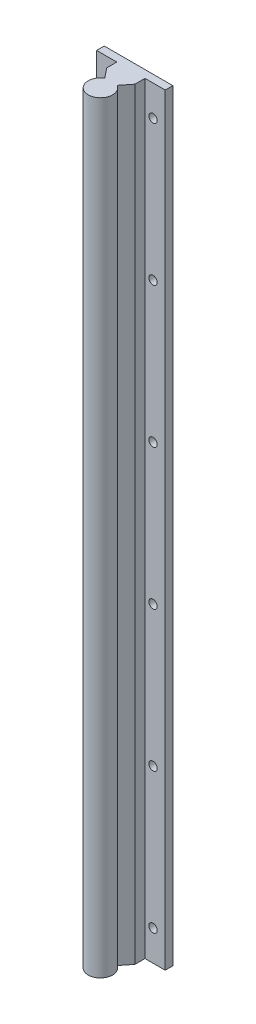
ISO-10303-21;
HEADER;
FILE_DESCRIPTION(('STEP AP214'),'2;1');
FILE_NAME('part.step','',(''),(''),'','','');
FILE_SCHEMA(('AUTOMOTIVE_DESIGN { 1 0 10303 214 1 1 1 1 }'));
ENDSEC;
DATA;
#1=APPLICATION_CONTEXT('core data for automotive mechanical design processes');
#2=APPLICATION_PROTOCOL_DEFINITION('international standard','automotive_design',2000,#1);
#3=PRODUCT_CONTEXT('',#1,'mechanical');
#4=PRODUCT('Part','Part','',(#3));
#5=PRODUCT_RELATED_PRODUCT_CATEGORY('part','',(#4));
#6=PRODUCT_DEFINITION_FORMATION('','',#4);
#7=PRODUCT_DEFINITION_CONTEXT('part definition',#1,'design');
#8=PRODUCT_DEFINITION('design','',#6,#7);
#9=PRODUCT_DEFINITION_SHAPE('','',#8);
#10=(LENGTH_UNIT() NAMED_UNIT(*) SI_UNIT(.MILLI.,.METRE.));
#11=(NAMED_UNIT(*) PLANE_ANGLE_UNIT() SI_UNIT($,.RADIAN.));
#12=(NAMED_UNIT(*) SI_UNIT($,.STERADIAN.) SOLID_ANGLE_UNIT());
#13=UNCERTAINTY_MEASURE_WITH_UNIT(LENGTH_MEASURE(1.E-05),#10,'distance_accuracy_value','');
#14=(GEOMETRIC_REPRESENTATION_CONTEXT(3) GLOBAL_UNCERTAINTY_ASSIGNED_CONTEXT((#13)) GLOBAL_UNIT_ASSIGNED_CONTEXT((#10,
#11,#12)) REPRESENTATION_CONTEXT('',''));
#15=CARTESIAN_POINT('',(0.,0.,0.));
#16=DIRECTION('',(0.,0.,1.));
#17=DIRECTION('',(1.,0.,0.));
#18=AXIS2_PLACEMENT_3D('',#15,#16,#17);
#19=CARTESIAN_POINT('',(0.,-500.,117.));
#20=DIRECTION('',(0.,0.,-1.));
#21=DIRECTION('',(-1.,0.,0.));
#22=AXIS2_PLACEMENT_3D('',#19,#20,#21);
#23=PLANE('',#22);
#24=CARTESIAN_POINT('',(37.0000000000019,-204.,117.));
#25=DIRECTION('',(0.,0.,1.));
#26=DIRECTION('',(-1.,0.,0.));
#27=AXIS2_PLACEMENT_3D('',#24,#25,#26);
#28=CIRCLE('',#27,2.75);
#29=CARTESIAN_POINT('',(34.2500000000019,-204.,117.));
#30=VERTEX_POINT('',#29);
#31=EDGE_CURVE('E393',#30,#30,#28,.T.);
#32=ORIENTED_EDGE('',*,*,#31,.T.);
#33=EDGE_LOOP('',(#32));
#34=FACE_BOUND('',#33,.T.);
#35=CARTESIAN_POINT('',(8.00000000000287,-296.,117.));
#36=DIRECTION('',(0.,0.,1.));
#37=DIRECTION('',(1.,0.,0.));
#38=AXIS2_PLACEMENT_3D('',#35,#36,#37);
#39=CIRCLE('',#38,2.75);
#40=CARTESIAN_POINT('',(10.7500000000029,-296.,117.));
#41=VERTEX_POINT('',#40);
#42=EDGE_CURVE('E399',#41,#41,#39,.T.);
#43=ORIENTED_EDGE('',*,*,#42,.T.);
#44=EDGE_LOOP('',(#43));
#45=FACE_BOUND('',#44,.T.);
#46=CARTESIAN_POINT('',(37.0000000000029,-296.,117.));
#47=DIRECTION('',(0.,0.,1.));
#48=DIRECTION('',(-1.,0.,0.));
#49=AXIS2_PLACEMENT_3D('',#46,#47,#48);
#50=CIRCLE('',#49,2.75);
#51=CARTESIAN_POINT('',(34.2500000000029,-296.,117.));
#52=VERTEX_POINT('',#51);
#53=EDGE_CURVE('E472',#52,#52,#50,.T.);
#54=ORIENTED_EDGE('',*,*,#53,.T.);
#55=EDGE_LOOP('',(#54));
#56=FACE_BOUND('',#55,.T.);
#57=CARTESIAN_POINT('',(8.00000000000383,-388.,117.));
#58=DIRECTION('',(0.,0.,1.));
#59=DIRECTION('',(1.,0.,0.));
#60=AXIS2_PLACEMENT_3D('',#57,#58,#59);
#61=CIRCLE('',#60,2.75);
#62=CARTESIAN_POINT('',(10.7500000000038,-388.,117.));
#63=VERTEX_POINT('',#62);
#64=EDGE_CURVE('E476',#63,#63,#61,.T.);
#65=ORIENTED_EDGE('',*,*,#64,.T.);
#66=EDGE_LOOP('',(#65));
#67=FACE_BOUND('',#66,.T.);
#68=CARTESIAN_POINT('',(37.,-20.,117.));
#69=DIRECTION('',(0.,0.,1.));
#70=DIRECTION('',(-1.,0.,0.));
#71=AXIS2_PLACEMENT_3D('',#68,#69,#70);
#72=CIRCLE('',#71,2.75);
#73=CARTESIAN_POINT('',(34.25,-20.,117.));
#74=VERTEX_POINT('',#73);
#75=EDGE_CURVE('E418',#74,#74,#72,.T.);
#76=ORIENTED_EDGE('',*,*,#75,.T.);
#77=EDGE_LOOP('',(#76));
#78=FACE_BOUND('',#77,.T.);
#79=CARTESIAN_POINT('',(8.00000000000096,-112.,117.));
#80=DIRECTION('',(0.,0.,1.));
#81=DIRECTION('',(1.,0.,0.));
#82=AXIS2_PLACEMENT_3D('',#79,#80,#81);
#83=CIRCLE('',#82,2.75);
#84=CARTESIAN_POINT('',(10.750000000001,-112.,117.));
#85=VERTEX_POINT('',#84);
#86=EDGE_CURVE('E406',#85,#85,#83,.T.);
#87=ORIENTED_EDGE('',*,*,#86,.T.);
#88=EDGE_LOOP('',(#87));
#89=FACE_BOUND('',#88,.T.);
#90=CARTESIAN_POINT('',(37.000000000001,-112.,117.));
#91=DIRECTION('',(0.,0.,1.));
#92=DIRECTION('',(-1.,0.,0.));
#93=AXIS2_PLACEMENT_3D('',#90,#91,#92);
#94=CIRCLE('',#93,2.75);
#95=CARTESIAN_POINT('',(34.250000000001,-112.,117.));
#96=VERTEX_POINT('',#95);
#97=EDGE_CURVE('E407',#96,#96,#94,.T.);
#98=ORIENTED_EDGE('',*,*,#97,.T.);
#99=EDGE_LOOP('',(#98));
#100=FACE_BOUND('',#99,.T.);
#101=CARTESIAN_POINT('',(8.00000000000192,-204.,117.));
#102=DIRECTION('',(0.,0.,1.));
#103=DIRECTION('',(1.,0.,0.));
#104=AXIS2_PLACEMENT_3D('',#101,#102,#103);
#105=CIRCLE('',#104,2.75);
#106=CARTESIAN_POINT('',(10.7500000000019,-204.,117.));
#107=VERTEX_POINT('',#106);
#108=EDGE_CURVE('E413',#107,#107,#105,.T.);
#109=ORIENTED_EDGE('',*,*,#108,.T.);
#110=EDGE_LOOP('',(#109));
#111=FACE_BOUND('',#110,.T.);
#112=CARTESIAN_POINT('',(37.0000000000048,-480.,117.));
#113=DIRECTION('',(0.,0.,1.));
#114=DIRECTION('',(-1.,0.,0.));
#115=AXIS2_PLACEMENT_3D('',#112,#113,#114);
#116=CIRCLE('',#115,2.75);
#117=CARTESIAN_POINT('',(34.2500000000048,-480.,117.));
#118=VERTEX_POINT('',#117);
#119=EDGE_CURVE('E486',#118,#118,#116,.T.);
#120=ORIENTED_EDGE('',*,*,#119,.T.);
#121=EDGE_LOOP('',(#120));
#122=FACE_BOUND('',#121,.T.);
#123=CARTESIAN_POINT('',(8.00000000000479,-480.,117.));
#124=DIRECTION('',(0.,0.,1.));
#125=DIRECTION('',(1.,0.,0.));
#126=AXIS2_PLACEMENT_3D('',#123,#124,#125);
#127=CIRCLE('',#126,2.75);
#128=CARTESIAN_POINT('',(10.7500000000048,-480.,117.));
#129=VERTEX_POINT('',#128);
#130=EDGE_CURVE('E491',#129,#129,#127,.T.);
#131=ORIENTED_EDGE('',*,*,#130,.T.);
#132=EDGE_LOOP('',(#131));
#133=FACE_BOUND('',#132,.T.);
#134=CARTESIAN_POINT('',(37.0000000000038,-388.,117.));
#135=DIRECTION('',(0.,0.,1.));
#136=DIRECTION('',(-1.,0.,0.));
#137=AXIS2_PLACEMENT_3D('',#134,#135,#136);
#138=CIRCLE('',#137,2.75);
#139=CARTESIAN_POINT('',(34.2500000000038,-388.,117.));
#140=VERTEX_POINT('',#139);
#141=EDGE_CURVE('E477',#140,#140,#138,.T.);
#142=ORIENTED_EDGE('',*,*,#141,.T.);
#143=EDGE_LOOP('',(#142));
#144=FACE_BOUND('',#143,.T.);
#145=CARTESIAN_POINT('',(8.,-20.,117.));
#146=DIRECTION('',(0.,0.,1.));
#147=DIRECTION('',(1.,0.,0.));
#148=AXIS2_PLACEMENT_3D('',#145,#146,#147);
#149=CIRCLE('',#148,2.75);
#150=CARTESIAN_POINT('',(10.75,-20.,117.));
#151=VERTEX_POINT('',#150);
#152=EDGE_CURVE('E354',#151,#151,#149,.T.);
#153=ORIENTED_EDGE('',*,*,#152,.T.);
#154=EDGE_LOOP('',(#153));
#155=FACE_BOUND('',#154,.T.);
#156=DIRECTION('',(0.,1.,0.));
#157=VECTOR('',#156,1.);
#158=CARTESIAN_POINT('',(0.,-500.,117.));
#159=LINE('',#158,#157);
#160=CARTESIAN_POINT('',(0.,-500.,117.));
#161=VERTEX_POINT('',#160);
#162=CARTESIAN_POINT('',(0.,0.,117.));
#163=VERTEX_POINT('',#162);
#164=EDGE_CURVE('E333',#161,#163,#159,.T.);
#165=ORIENTED_EDGE('',*,*,#164,.T.);
#166=DIRECTION('',(1.,0.,0.));
#167=VECTOR('',#166,1.);
#168=CARTESIAN_POINT('',(0.,0.,117.));
#169=LINE('',#168,#167);
#170=CARTESIAN_POINT('',(45.,0.,117.));
#171=VERTEX_POINT('',#170);
#172=EDGE_CURVE('E293',#163,#171,#169,.T.);
#173=ORIENTED_EDGE('',*,*,#172,.T.);
#174=DIRECTION('',(0.,1.,0.));
#175=VECTOR('',#174,1.);
#176=CARTESIAN_POINT('',(45.,-500.,117.));
#177=LINE('',#176,#175);
#178=CARTESIAN_POINT('',(45.,-500.,117.));
#179=VERTEX_POINT('',#178);
#180=EDGE_CURVE('E277',#179,#171,#177,.T.);
#181=ORIENTED_EDGE('',*,*,#180,.F.);
#182=DIRECTION('',(1.,0.,0.));
#183=VECTOR('',#182,1.);
#184=CARTESIAN_POINT('',(0.,-500.,117.));
#185=LINE('',#184,#183);
#186=EDGE_CURVE('E287',#161,#179,#185,.T.);
#187=ORIENTED_EDGE('',*,*,#186,.F.);
#188=EDGE_LOOP('',(#165,#173,#181,#187));
#189=FACE_BOUND('',#188,.T.);
#190=ADVANCED_FACE('F54',(#34,#45,#56,#67,#78,#89,#100,#111,#122,#133,#144,#155,#189),#23,.T.);
#191=CARTESIAN_POINT('',(45.,-500.,117.));
#192=DIRECTION('',(1.,0.,0.));
#193=DIRECTION('',(0.,1.,0.));
#194=AXIS2_PLACEMENT_3D('',#191,#192,#193);
#195=PLANE('',#194);
#196=ORIENTED_EDGE('',*,*,#180,.T.);
#197=DIRECTION('',(0.,0.,1.));
#198=VECTOR('',#197,1.);
#199=CARTESIAN_POINT('',(45.,0.,117.));
#200=LINE('',#199,#198);
#201=CARTESIAN_POINT('',(45.,0.,122.));
#202=VERTEX_POINT('',#201);
#203=EDGE_CURVE('E297',#171,#202,#200,.T.);
#204=ORIENTED_EDGE('',*,*,#203,.T.);
#205=DIRECTION('',(0.,1.,0.));
#206=VECTOR('',#205,1.);
#207=CARTESIAN_POINT('',(45.,-500.,122.));
#208=LINE('',#207,#206);
#209=CARTESIAN_POINT('',(45.,-500.,122.));
#210=VERTEX_POINT('',#209);
#211=EDGE_CURVE('E310',#210,#202,#208,.T.);
#212=ORIENTED_EDGE('',*,*,#211,.F.);
#213=DIRECTION('',(0.,0.,1.));
#214=VECTOR('',#213,1.);
#215=CARTESIAN_POINT('',(45.,-500.,117.));
#216=LINE('',#215,#214);
#217=EDGE_CURVE('E303',#179,#210,#216,.T.);
#218=ORIENTED_EDGE('',*,*,#217,.F.);
#219=EDGE_LOOP('',(#196,#204,#212,#218));
#220=FACE_BOUND('',#219,.T.);
#221=ADVANCED_FACE('F523',(#220),#195,.T.);
#222=CARTESIAN_POINT('',(37.,-500.,122.));
#223=DIRECTION('',(0.,0.,1.));
#224=DIRECTION('',(0.,-1.,0.));
#225=AXIS2_PLACEMENT_3D('',#222,#223,#224);
#226=PLANE('',#225);
#227=DIRECTION('',(-1.,0.,0.));
#228=VECTOR('',#227,1.);
#229=CARTESIAN_POINT('',(37.,0.,122.));
#230=LINE('',#229,#228);
#231=CARTESIAN_POINT('',(37.,0.,122.));
#232=VERTEX_POINT('',#231);
#233=CARTESIAN_POINT('',(31.75,0.,122.));
#234=VERTEX_POINT('',#233);
#235=EDGE_CURVE('E321',#232,#234,#230,.T.);
#236=ORIENTED_EDGE('',*,*,#235,.T.);
#237=DIRECTION('',(0.,1.,0.));
#238=VECTOR('',#237,1.);
#239=CARTESIAN_POINT('',(31.75,-500.,122.));
#240=LINE('',#239,#238);
#241=CARTESIAN_POINT('',(31.75,-500.,122.));
#242=VERTEX_POINT('',#241);
#243=EDGE_CURVE('E274',#242,#234,#240,.T.);
#244=ORIENTED_EDGE('',*,*,#243,.F.);
#245=DIRECTION('',(-1.,0.,0.));
#246=VECTOR('',#245,1.);
#247=CARTESIAN_POINT('',(37.,-500.,122.));
#248=LINE('',#247,#246);
#249=CARTESIAN_POINT('',(37.,-500.,122.));
#250=VERTEX_POINT('',#249);
#251=EDGE_CURVE('E345',#250,#242,#248,.T.);
#252=ORIENTED_EDGE('',*,*,#251,.F.);
#253=DIRECTION('',(-1.,0.,0.));
#254=VECTOR('',#253,1.);
#255=CARTESIAN_POINT('',(45.,-500.,122.));
#256=LINE('',#255,#254);
#257=EDGE_CURVE('E306',#210,#250,#256,.T.);
#258=ORIENTED_EDGE('',*,*,#257,.F.);
#259=ORIENTED_EDGE('',*,*,#211,.T.);
#260=DIRECTION('',(-1.,0.,0.));
#261=VECTOR('',#260,1.);
#262=CARTESIAN_POINT('',(45.,0.,122.));
#263=LINE('',#262,#261);
#264=EDGE_CURVE('E324',#202,#232,#263,.T.);
#265=ORIENTED_EDGE('',*,*,#264,.T.);
#266=EDGE_LOOP('',(#236,#244,#252,#258,#259,#265));
#267=FACE_BOUND('',#266,.T.);
#268=CARTESIAN_POINT('',(37.,-20.,122.));
#269=DIRECTION('',(0.,0.,1.));
#270=DIRECTION('',(-1.,0.,0.));
#271=AXIS2_PLACEMENT_3D('',#268,#269,#270);
#272=CIRCLE('',#271,2.75);
#273=CARTESIAN_POINT('',(37.,-22.75,122.));
#274=VERTEX_POINT('',#273);
#275=CARTESIAN_POINT('',(37.,-17.25,122.));
#276=VERTEX_POINT('',#275);
#277=EDGE_CURVE('E67',#274,#276,#272,.T.);
#278=ORIENTED_EDGE('',*,*,#277,.F.);
#279=CARTESIAN_POINT('',(37.,-20.,122.));
#280=DIRECTION('',(0.,0.,1.));
#281=DIRECTION('',(0.,-1.,0.));
#282=AXIS2_PLACEMENT_3D('',#279,#280,#281);
#283=CIRCLE('',#282,2.75);
#284=EDGE_CURVE('E468',#276,#274,#283,.T.);
#285=ORIENTED_EDGE('',*,*,#284,.F.);
#286=EDGE_LOOP('',(#278,#285));
#287=FACE_BOUND('',#286,.T.);
#288=CARTESIAN_POINT('',(37.0000000000048,-480.,122.));
#289=DIRECTION('',(0.,0.,1.));
#290=DIRECTION('',(0.,-1.,0.));
#291=AXIS2_PLACEMENT_3D('',#288,#289,#290);
#292=CIRCLE('',#291,2.75);
#293=CARTESIAN_POINT('',(37.,-477.25,122.));
#294=VERTEX_POINT('',#293);
#295=CARTESIAN_POINT('',(37.,-482.75,122.));
#296=VERTEX_POINT('',#295);
#297=EDGE_CURVE('E464',#294,#296,#292,.T.);
#298=ORIENTED_EDGE('',*,*,#297,.F.);
#299=CARTESIAN_POINT('',(37.0000000000048,-480.,122.));
#300=DIRECTION('',(0.,0.,1.));
#301=DIRECTION('',(-1.,0.,0.));
#302=AXIS2_PLACEMENT_3D('',#299,#300,#301);
#303=CIRCLE('',#302,2.75);
#304=EDGE_CURVE('E493',#296,#294,#303,.T.);
#305=ORIENTED_EDGE('',*,*,#304,.F.);
#306=EDGE_LOOP('',(#298,#305));
#307=FACE_BOUND('',#306,.T.);
#308=CARTESIAN_POINT('',(37.0000000000038,-388.,122.));
#309=DIRECTION('',(0.,0.,1.));
#310=DIRECTION('',(-1.,0.,0.));
#311=AXIS2_PLACEMENT_3D('',#308,#309,#310);
#312=CIRCLE('',#311,2.75);
#313=CARTESIAN_POINT('',(37.,-390.75,122.));
#314=VERTEX_POINT('',#313);
#315=CARTESIAN_POINT('',(37.,-385.25,122.));
#316=VERTEX_POINT('',#315);
#317=EDGE_CURVE('E254',#314,#316,#312,.T.);
#318=ORIENTED_EDGE('',*,*,#317,.F.);
#319=CARTESIAN_POINT('',(37.0000000000038,-388.,122.));
#320=DIRECTION('',(0.,0.,1.));
#321=DIRECTION('',(0.,-1.,0.));
#322=AXIS2_PLACEMENT_3D('',#319,#320,#321);
#323=CIRCLE('',#322,2.75);
#324=EDGE_CURVE('E462',#316,#314,#323,.T.);
#325=ORIENTED_EDGE('',*,*,#324,.F.);
#326=EDGE_LOOP('',(#318,#325));
#327=FACE_BOUND('',#326,.T.);
#328=CARTESIAN_POINT('',(37.0000000000029,-296.,122.));
#329=DIRECTION('',(0.,0.,1.));
#330=DIRECTION('',(0.,-1.,0.));
#331=AXIS2_PLACEMENT_3D('',#328,#329,#330);
#332=CIRCLE('',#331,2.75);
#333=CARTESIAN_POINT('',(37.,-293.25,122.));
#334=VERTEX_POINT('',#333);
#335=CARTESIAN_POINT('',(37.,-298.75,122.));
#336=VERTEX_POINT('',#335);
#337=EDGE_CURVE('E61',#334,#336,#332,.T.);
#338=ORIENTED_EDGE('',*,*,#337,.F.);
#339=CARTESIAN_POINT('',(37.0000000000029,-296.,122.));
#340=DIRECTION('',(0.,0.,1.));
#341=DIRECTION('',(-1.,0.,0.));
#342=AXIS2_PLACEMENT_3D('',#339,#340,#341);
#343=CIRCLE('',#342,2.75);
#344=EDGE_CURVE('E404',#336,#334,#343,.T.);
#345=ORIENTED_EDGE('',*,*,#344,.F.);
#346=EDGE_LOOP('',(#338,#345));
#347=FACE_BOUND('',#346,.T.);
#348=CARTESIAN_POINT('',(37.0000000000019,-204.,122.));
#349=DIRECTION('',(0.,0.,1.));
#350=DIRECTION('',(-1.,0.,0.));
#351=AXIS2_PLACEMENT_3D('',#348,#349,#350);
#352=CIRCLE('',#351,2.75);
#353=CARTESIAN_POINT('',(37.,-206.75,122.));
#354=VERTEX_POINT('',#353);
#355=CARTESIAN_POINT('',(37.,-201.25,122.));
#356=VERTEX_POINT('',#355);
#357=EDGE_CURVE('E397',#354,#356,#352,.T.);
#358=ORIENTED_EDGE('',*,*,#357,.F.);
#359=CARTESIAN_POINT('',(37.0000000000019,-204.,122.));
#360=DIRECTION('',(0.,0.,1.));
#361=DIRECTION('',(0.,-1.,0.));
#362=AXIS2_PLACEMENT_3D('',#359,#360,#361);
#363=CIRCLE('',#362,2.75);
#364=EDGE_CURVE('E11',#356,#354,#363,.T.);
#365=ORIENTED_EDGE('',*,*,#364,.F.);
#366=EDGE_LOOP('',(#358,#365));
#367=FACE_BOUND('',#366,.T.);
#368=CARTESIAN_POINT('',(37.000000000001,-112.,122.));
#369=DIRECTION('',(0.,0.,1.));
#370=DIRECTION('',(0.,-1.,0.));
#371=AXIS2_PLACEMENT_3D('',#368,#369,#370);
#372=CIRCLE('',#371,2.75);
#373=CARTESIAN_POINT('',(37.,-109.25,122.));
#374=VERTEX_POINT('',#373);
#375=CARTESIAN_POINT('',(37.,-114.75,122.));
#376=VERTEX_POINT('',#375);
#377=EDGE_CURVE('E466',#374,#376,#372,.T.);
#378=ORIENTED_EDGE('',*,*,#377,.F.);
#379=CARTESIAN_POINT('',(37.000000000001,-112.,122.));
#380=DIRECTION('',(0.,0.,1.));
#381=DIRECTION('',(-1.,0.,0.));
#382=AXIS2_PLACEMENT_3D('',#379,#380,#381);
#383=CIRCLE('',#382,2.75);
#384=EDGE_CURVE('E74',#376,#374,#383,.T.);
#385=ORIENTED_EDGE('',*,*,#384,.F.);
#386=EDGE_LOOP('',(#378,#385));
#387=FACE_BOUND('',#386,.T.);
#388=ADVANCED_FACE('F250',(#267,#287,#307,#327,#347,#367,#387),#226,.T.);
#389=CARTESIAN_POINT('',(31.75,-500.,122.));
#390=DIRECTION('',(1.,0.,0.));
#391=DIRECTION('',(0.,1.,0.));
#392=AXIS2_PLACEMENT_3D('',#389,#390,#391);
#393=PLANE('',#392);
#394=DIRECTION('',(0.,0.,1.));
#395=VECTOR('',#394,1.);
#396=CARTESIAN_POINT('',(31.75,-500.,122.));
#397=LINE('',#396,#395);
#398=CARTESIAN_POINT('',(31.75,-500.,128.60352404883));
#399=VERTEX_POINT('',#398);
#400=EDGE_CURVE('E348',#242,#399,#397,.T.);
#401=ORIENTED_EDGE('',*,*,#400,.F.);
#402=ORIENTED_EDGE('',*,*,#243,.T.);
#403=DIRECTION('',(0.,0.,1.));
#404=VECTOR('',#403,1.);
#405=CARTESIAN_POINT('',(31.75,0.,122.));
#406=LINE('',#405,#404);
#407=CARTESIAN_POINT('',(31.75,0.,128.60352404883));
#408=VERTEX_POINT('',#407);
#409=EDGE_CURVE('E319',#234,#408,#406,.T.);
#410=ORIENTED_EDGE('',*,*,#409,.T.);
#411=DIRECTION('',(0.,1.,0.));
#412=VECTOR('',#411,1.);
#413=CARTESIAN_POINT('',(31.75,-500.,128.60352404883));
#414=LINE('',#413,#412);
#415=EDGE_CURVE('E350',#399,#408,#414,.T.);
#416=ORIENTED_EDGE('',*,*,#415,.F.);
#417=EDGE_LOOP('',(#401,#402,#410,#416));
#418=FACE_BOUND('',#417,.T.);
#419=ADVANCED_FACE('F594',(#418),#393,.T.);
#420=CARTESIAN_POINT('',(37.,-500.,122.));
#421=DIRECTION('',(0.782762913228078,0.,0.622320031555062));
#422=DIRECTION('',(0.,-1.,0.));
#423=AXIS2_PLACEMENT_3D('',#420,#421,#422);
#424=PLANE('',#423);
#425=DIRECTION('',(-0.622320031555062,0.,0.782762913228078));
#426=VECTOR('',#425,1.);
#427=CARTESIAN_POINT('',(37.,-500.,122.));
#428=LINE('',#427,#426);
#429=CARTESIAN_POINT('',(26.573415482902,-500.,135.11470506778));
#430=VERTEX_POINT('',#429);
#431=EDGE_CURVE('E357',#399,#430,#428,.T.);
#432=ORIENTED_EDGE('',*,*,#431,.F.);
#433=ORIENTED_EDGE('',*,*,#415,.T.);
#434=DIRECTION('',(-0.622320031555062,0.,0.782762913228078));
#435=VECTOR('',#434,1.);
#436=CARTESIAN_POINT('',(37.,0.,122.));
#437=LINE('',#436,#435);
#438=CARTESIAN_POINT('',(26.573415482902,0.,135.11470506778));
#439=VERTEX_POINT('',#438);
#440=EDGE_CURVE('E316',#408,#439,#437,.T.);
#441=ORIENTED_EDGE('',*,*,#440,.T.);
#442=DIRECTION('',(0.,1.,0.));
#443=VECTOR('',#442,1.);
#444=CARTESIAN_POINT('',(26.573415482902,-500.,135.11470506778));
#445=LINE('',#444,#443);
#446=EDGE_CURVE('E344',#430,#439,#445,.T.);
#447=ORIENTED_EDGE('',*,*,#446,.F.);
#448=EDGE_LOOP('',(#432,#433,#441,#447));
#449=FACE_BOUND('',#448,.T.);
#450=ADVANCED_FACE('F454',(#449),#424,.T.);
#451=CARTESIAN_POINT('',(22.5,-500.,142.));
#452=DIRECTION('',(0.,-1.,0.));
#453=DIRECTION('',(1.,0.,0.));
#454=AXIS2_PLACEMENT_3D('',#451,#452,#453);
#455=CYLINDRICAL_SURFACE('',#454,8.);
#456=ORIENTED_EDGE('',*,*,#446,.T.);
#457=CARTESIAN_POINT('',(22.5,0.,142.));
#458=DIRECTION('',(0.,-1.,0.));
#459=DIRECTION('',(1.,0.,0.));
#460=AXIS2_PLACEMENT_3D('',#457,#458,#459);
#461=CIRCLE('',#460,8.);
#462=CARTESIAN_POINT('',(18.434923321881,0.,135.1097785521));
#463=VERTEX_POINT('',#462);
#464=EDGE_CURVE('E320',#439,#463,#461,.T.);
#465=ORIENTED_EDGE('',*,*,#464,.T.);
#466=DIRECTION('',(0.,1.,0.));
#467=VECTOR('',#466,1.);
#468=CARTESIAN_POINT('',(18.434923321881,-500.,135.1097785521));
#469=LINE('',#468,#467);
#470=CARTESIAN_POINT('',(18.434923321881,-500.,135.1097785521));
#471=VERTEX_POINT('',#470);
#472=EDGE_CURVE('E327',#471,#463,#469,.T.);
#473=ORIENTED_EDGE('',*,*,#472,.F.);
#474=CARTESIAN_POINT('',(22.5,-500.,142.));
#475=DIRECTION('',(0.,-1.,0.));
#476=DIRECTION('',(1.,0.,0.));
#477=AXIS2_PLACEMENT_3D('',#474,#475,#476);
#478=CIRCLE('',#477,8.);
#479=EDGE_CURVE('E302',#430,#471,#478,.T.);
#480=ORIENTED_EDGE('',*,*,#479,.F.);
#481=EDGE_LOOP('',(#456,#465,#473,#480));
#482=FACE_BOUND('',#481,.T.);
#483=ADVANCED_FACE('F447',(#482),#455,.T.);
#484=CARTESIAN_POINT('',(8.,-500.,122.));
#485=DIRECTION('',(0.782406487002933,0.,-0.622768086124947));
#486=DIRECTION('',(0.,-1.,0.));
#487=AXIS2_PLACEMENT_3D('',#484,#485,#486);
#488=PLANE('',#487);
#489=ORIENTED_EDGE('',*,*,#472,.T.);
#490=DIRECTION('',(0.622768086124947,0.,0.782406487002933));
#491=VECTOR('',#490,1.);
#492=CARTESIAN_POINT('',(8.,0.,122.));
#493=LINE('',#492,#491);
#494=CARTESIAN_POINT('',(13.25,0.,128.59576839));
#495=VERTEX_POINT('',#494);
#496=EDGE_CURVE('E332',#495,#463,#493,.T.);
#497=ORIENTED_EDGE('',*,*,#496,.F.);
#498=DIRECTION('',(0.,-1.,0.));
#499=VECTOR('',#498,1.);
#500=CARTESIAN_POINT('',(13.25,-500.,128.59576839));
#501=LINE('',#500,#499);
#502=CARTESIAN_POINT('',(13.25,-500.,128.59576839));
#503=VERTEX_POINT('',#502);
#504=EDGE_CURVE('E325',#495,#503,#501,.T.);
#505=ORIENTED_EDGE('',*,*,#504,.T.);
#506=DIRECTION('',(0.622768086124947,0.,0.782406487002933));
#507=VECTOR('',#506,1.);
#508=CARTESIAN_POINT('',(8.,-500.,122.));
#509=LINE('',#508,#507);
#510=EDGE_CURVE('E298',#503,#471,#509,.T.);
#511=ORIENTED_EDGE('',*,*,#510,.T.);
#512=EDGE_LOOP('',(#489,#497,#505,#511));
#513=FACE_BOUND('',#512,.T.);
#514=ADVANCED_FACE('F445',(#513),#488,.F.);
#515=CARTESIAN_POINT('',(13.25,-500.,122.));
#516=DIRECTION('',(1.,0.,0.));
#517=DIRECTION('',(0.,1.,0.));
#518=AXIS2_PLACEMENT_3D('',#515,#516,#517);
#519=PLANE('',#518);
#520=ORIENTED_EDGE('',*,*,#504,.F.);
#521=DIRECTION('',(0.,0.,1.));
#522=VECTOR('',#521,1.);
#523=CARTESIAN_POINT('',(13.25,0.,122.));
#524=LINE('',#523,#522);
#525=CARTESIAN_POINT('',(13.25,0.,122.));
#526=VERTEX_POINT('',#525);
#527=EDGE_CURVE('E329',#526,#495,#524,.T.);
#528=ORIENTED_EDGE('',*,*,#527,.F.);
#529=DIRECTION('',(0.,1.,0.));
#530=VECTOR('',#529,1.);
#531=CARTESIAN_POINT('',(13.25,-500.,122.));
#532=LINE('',#531,#530);
#533=CARTESIAN_POINT('',(13.25,-500.,122.));
#534=VERTEX_POINT('',#533);
#535=EDGE_CURVE('E328',#534,#526,#532,.T.);
#536=ORIENTED_EDGE('',*,*,#535,.F.);
#537=DIRECTION('',(0.,0.,1.));
#538=VECTOR('',#537,1.);
#539=CARTESIAN_POINT('',(13.25,-500.,122.));
#540=LINE('',#539,#538);
#541=EDGE_CURVE('E301',#534,#503,#540,.T.);
#542=ORIENTED_EDGE('',*,*,#541,.T.);
#543=EDGE_LOOP('',(#520,#528,#536,#542));
#544=FACE_BOUND('',#543,.T.);
#545=ADVANCED_FACE('F442',(#544),#519,.F.);
#546=CARTESIAN_POINT('',(22.500226816281,0.,127.27741969966));
#547=DIRECTION('',(0.,-1.,0.));
#548=DIRECTION('',(0.,0.,-1.));
#549=AXIS2_PLACEMENT_3D('',#546,#547,#548);
#550=PLANE('',#549);
#551=ORIENTED_EDGE('',*,*,#527,.T.);
#552=ORIENTED_EDGE('',*,*,#496,.T.);
#553=ORIENTED_EDGE('',*,*,#464,.F.);
#554=ORIENTED_EDGE('',*,*,#440,.F.);
#555=ORIENTED_EDGE('',*,*,#409,.F.);
#556=ORIENTED_EDGE('',*,*,#235,.F.);
#557=ORIENTED_EDGE('',*,*,#264,.F.);
#558=ORIENTED_EDGE('',*,*,#203,.F.);
#559=ORIENTED_EDGE('',*,*,#172,.F.);
#560=DIRECTION('',(0.,0.,-1.));
#561=VECTOR('',#560,1.);
#562=CARTESIAN_POINT('',(0.,0.,122.));
#563=LINE('',#562,#561);
#564=CARTESIAN_POINT('',(0.,0.,122.));
#565=VERTEX_POINT('',#564);
#566=EDGE_CURVE('E314',#565,#163,#563,.T.);
#567=ORIENTED_EDGE('',*,*,#566,.F.);
#568=DIRECTION('',(-1.,0.,0.));
#569=VECTOR('',#568,1.);
#570=CARTESIAN_POINT('',(8.,0.,122.));
#571=LINE('',#570,#569);
#572=CARTESIAN_POINT('',(8.,0.,122.));
#573=VERTEX_POINT('',#572);
#574=EDGE_CURVE('E292',#573,#565,#571,.T.);
#575=ORIENTED_EDGE('',*,*,#574,.F.);
#576=DIRECTION('',(1.,0.,0.));
#577=VECTOR('',#576,1.);
#578=CARTESIAN_POINT('',(8.,0.,122.));
#579=LINE('',#578,#577);
#580=EDGE_CURVE('E296',#573,#526,#579,.T.);
#581=ORIENTED_EDGE('',*,*,#580,.T.);
#582=EDGE_LOOP('',(#551,#552,#553,#554,#555,#556,#557,#558,#559,#567,#575,#581));
#583=FACE_BOUND('',#582,.T.);
#584=ADVANCED_FACE('F441',(#583),#550,.F.);
#585=CARTESIAN_POINT('',(0.,-500.,122.));
#586=DIRECTION('',(-1.,0.,0.));
#587=DIRECTION('',(0.,0.,1.));
#588=AXIS2_PLACEMENT_3D('',#585,#586,#587);
#589=PLANE('',#588);
#590=DIRECTION('',(0.,1.,0.));
#591=VECTOR('',#590,1.);
#592=CARTESIAN_POINT('',(0.,-500.,122.));
#593=LINE('',#592,#591);
#594=CARTESIAN_POINT('',(0.,-500.,122.));
#595=VERTEX_POINT('',#594);
#596=EDGE_CURVE('E289',#595,#565,#593,.T.);
#597=ORIENTED_EDGE('',*,*,#596,.T.);
#598=ORIENTED_EDGE('',*,*,#566,.T.);
#599=ORIENTED_EDGE('',*,*,#164,.F.);
#600=DIRECTION('',(0.,0.,-1.));
#601=VECTOR('',#600,1.);
#602=CARTESIAN_POINT('',(0.,-500.,122.));
#603=LINE('',#602,#601);
#604=EDGE_CURVE('E284',#595,#161,#603,.T.);
#605=ORIENTED_EDGE('',*,*,#604,.F.);
#606=EDGE_LOOP('',(#597,#598,#599,#605));
#607=FACE_BOUND('',#606,.T.);
#608=ADVANCED_FACE('F558',(#607),#589,.T.);
#609=CARTESIAN_POINT('',(22.500226816281,-500.,127.27741969966));
#610=DIRECTION('',(0.,-1.,0.));
#611=DIRECTION('',(0.,0.,-1.));
#612=AXIS2_PLACEMENT_3D('',#609,#610,#611);
#613=PLANE('',#612);
#614=DIRECTION('',(1.,0.,0.));
#615=VECTOR('',#614,1.);
#616=CARTESIAN_POINT('',(8.,-500.,122.));
#617=LINE('',#616,#615);
#618=CARTESIAN_POINT('',(8.,-500.,122.));
#619=VERTEX_POINT('',#618);
#620=EDGE_CURVE('E288',#619,#534,#617,.T.);
#621=ORIENTED_EDGE('',*,*,#620,.F.);
#622=DIRECTION('',(-1.,0.,0.));
#623=VECTOR('',#622,1.);
#624=CARTESIAN_POINT('',(8.,-500.,122.));
#625=LINE('',#624,#623);
#626=EDGE_CURVE('E351',#619,#595,#625,.T.);
#627=ORIENTED_EDGE('',*,*,#626,.T.);
#628=ORIENTED_EDGE('',*,*,#604,.T.);
#629=ORIENTED_EDGE('',*,*,#186,.T.);
#630=ORIENTED_EDGE('',*,*,#217,.T.);
#631=ORIENTED_EDGE('',*,*,#257,.T.);
#632=ORIENTED_EDGE('',*,*,#251,.T.);
#633=ORIENTED_EDGE('',*,*,#400,.T.);
#634=ORIENTED_EDGE('',*,*,#431,.T.);
#635=ORIENTED_EDGE('',*,*,#479,.T.);
#636=ORIENTED_EDGE('',*,*,#510,.F.);
#637=ORIENTED_EDGE('',*,*,#541,.F.);
#638=EDGE_LOOP('',(#621,#627,#628,#629,#630,#631,#632,#633,#634,#635,#636,#637));
#639=FACE_BOUND('',#638,.T.);
#640=ADVANCED_FACE('F451',(#639),#613,.T.);
#641=CARTESIAN_POINT('',(8.,-500.,122.));
#642=DIRECTION('',(0.,0.,1.));
#643=DIRECTION('',(0.,-1.,0.));
#644=AXIS2_PLACEMENT_3D('',#641,#642,#643);
#645=PLANE('',#644);
#646=ORIENTED_EDGE('',*,*,#620,.T.);
#647=ORIENTED_EDGE('',*,*,#535,.T.);
#648=ORIENTED_EDGE('',*,*,#580,.F.);
#649=ORIENTED_EDGE('',*,*,#574,.T.);
#650=ORIENTED_EDGE('',*,*,#596,.F.);
#651=ORIENTED_EDGE('',*,*,#626,.F.);
#652=EDGE_LOOP('',(#646,#647,#648,#649,#650,#651));
#653=FACE_BOUND('',#652,.T.);
#654=CARTESIAN_POINT('',(8.00000000000479,-480.,122.));
#655=DIRECTION('',(0.,0.,1.));
#656=DIRECTION('',(1.,0.,0.));
#657=AXIS2_PLACEMENT_3D('',#654,#655,#656);
#658=CIRCLE('',#657,2.75);
#659=CARTESIAN_POINT('',(8.,-477.25,122.));
#660=VERTEX_POINT('',#659);
#661=CARTESIAN_POINT('',(8.,-482.75,122.));
#662=VERTEX_POINT('',#661);
#663=EDGE_CURVE('E483',#660,#662,#658,.T.);
#664=ORIENTED_EDGE('',*,*,#663,.F.);
#665=EDGE_CURVE('E490',#662,#660,#658,.T.);
#666=ORIENTED_EDGE('',*,*,#665,.F.);
#667=EDGE_LOOP('',(#664,#666));
#668=FACE_BOUND('',#667,.T.);
#669=CARTESIAN_POINT('',(8.,-20.,122.));
#670=DIRECTION('',(0.,0.,1.));
#671=DIRECTION('',(1.,0.,0.));
#672=AXIS2_PLACEMENT_3D('',#669,#670,#671);
#673=CIRCLE('',#672,2.75);
#674=CARTESIAN_POINT('',(8.,-22.75,122.));
#675=VERTEX_POINT('',#674);
#676=CARTESIAN_POINT('',(8.,-17.25,122.));
#677=VERTEX_POINT('',#676);
#678=EDGE_CURVE('E417',#675,#677,#673,.T.);
#679=ORIENTED_EDGE('',*,*,#678,.F.);
#680=EDGE_CURVE('E428',#677,#675,#673,.T.);
#681=ORIENTED_EDGE('',*,*,#680,.F.);
#682=EDGE_LOOP('',(#679,#681));
#683=FACE_BOUND('',#682,.T.);
#684=CARTESIAN_POINT('',(8.00000000000096,-112.,122.));
#685=DIRECTION('',(0.,0.,1.));
#686=DIRECTION('',(1.,0.,0.));
#687=AXIS2_PLACEMENT_3D('',#684,#685,#686);
#688=CIRCLE('',#687,2.75);
#689=CARTESIAN_POINT('',(8.,-109.25,122.));
#690=VERTEX_POINT('',#689);
#691=CARTESIAN_POINT('',(8.,-114.75,122.));
#692=VERTEX_POINT('',#691);
#693=EDGE_CURVE('E421',#690,#692,#688,.T.);
#694=ORIENTED_EDGE('',*,*,#693,.F.);
#695=EDGE_CURVE('E423',#692,#690,#688,.T.);
#696=ORIENTED_EDGE('',*,*,#695,.F.);
#697=EDGE_LOOP('',(#694,#696));
#698=FACE_BOUND('',#697,.T.);
#699=CARTESIAN_POINT('',(8.00000000000192,-204.,122.));
#700=DIRECTION('',(0.,0.,1.));
#701=DIRECTION('',(1.,0.,0.));
#702=AXIS2_PLACEMENT_3D('',#699,#700,#701);
#703=CIRCLE('',#702,2.75);
#704=CARTESIAN_POINT('',(8.,-206.75,122.));
#705=VERTEX_POINT('',#704);
#706=CARTESIAN_POINT('',(8.,-201.25,122.));
#707=VERTEX_POINT('',#706);
#708=EDGE_CURVE('E412',#705,#707,#703,.T.);
#709=ORIENTED_EDGE('',*,*,#708,.F.);
#710=EDGE_CURVE('E410',#707,#705,#703,.T.);
#711=ORIENTED_EDGE('',*,*,#710,.F.);
#712=EDGE_LOOP('',(#709,#711));
#713=FACE_BOUND('',#712,.T.);
#714=CARTESIAN_POINT('',(8.00000000000383,-388.,122.));
#715=DIRECTION('',(0.,0.,1.));
#716=DIRECTION('',(1.,0.,0.));
#717=AXIS2_PLACEMENT_3D('',#714,#715,#716);
#718=CIRCLE('',#717,2.75);
#719=CARTESIAN_POINT('',(8.,-390.75,122.));
#720=VERTEX_POINT('',#719);
#721=CARTESIAN_POINT('',(8.,-385.25,122.));
#722=VERTEX_POINT('',#721);
#723=EDGE_CURVE('E480',#720,#722,#718,.T.);
#724=ORIENTED_EDGE('',*,*,#723,.F.);
#725=EDGE_CURVE('E497',#722,#720,#718,.T.);
#726=ORIENTED_EDGE('',*,*,#725,.F.);
#727=EDGE_LOOP('',(#724,#726));
#728=FACE_BOUND('',#727,.T.);
#729=CARTESIAN_POINT('',(8.00000000000287,-296.,122.));
#730=DIRECTION('',(0.,0.,1.));
#731=DIRECTION('',(1.,0.,0.));
#732=AXIS2_PLACEMENT_3D('',#729,#730,#731);
#733=CIRCLE('',#732,2.75);
#734=CARTESIAN_POINT('',(8.,-293.25,122.));
#735=VERTEX_POINT('',#734);
#736=CARTESIAN_POINT('',(8.,-298.75,122.));
#737=VERTEX_POINT('',#736);
#738=EDGE_CURVE('E390',#735,#737,#733,.T.);
#739=ORIENTED_EDGE('',*,*,#738,.F.);
#740=EDGE_CURVE('E394',#737,#735,#733,.T.);
#741=ORIENTED_EDGE('',*,*,#740,.F.);
#742=EDGE_LOOP('',(#739,#741));
#743=FACE_BOUND('',#742,.T.);
#744=ADVANCED_FACE('F388',(#653,#668,#683,#698,#713,#728,#743),#645,.T.);
#745=CARTESIAN_POINT('',(8.,-20.,117.));
#746=DIRECTION('',(0.,0.,1.));
#747=DIRECTION('',(1.,0.,0.));
#748=AXIS2_PLACEMENT_3D('',#745,#746,#747);
#749=CYLINDRICAL_SURFACE('',#748,2.75);
#750=ORIENTED_EDGE('',*,*,#152,.F.);
#751=EDGE_LOOP('',(#750));
#752=FACE_BOUND('',#751,.T.);
#753=ORIENTED_EDGE('',*,*,#680,.T.);
#754=ORIENTED_EDGE('',*,*,#678,.T.);
#755=EDGE_LOOP('',(#753,#754));
#756=FACE_BOUND('',#755,.T.);
#757=ADVANCED_FACE('F569',(#752,#756),#749,.F.);
#758=CARTESIAN_POINT('',(8.00000000000479,-480.,117.));
#759=DIRECTION('',(0.,0.,1.));
#760=DIRECTION('',(1.,0.,0.));
#761=AXIS2_PLACEMENT_3D('',#758,#759,#760);
#762=CYLINDRICAL_SURFACE('',#761,2.75);
#763=ORIENTED_EDGE('',*,*,#130,.F.);
#764=EDGE_LOOP('',(#763));
#765=FACE_BOUND('',#764,.T.);
#766=ORIENTED_EDGE('',*,*,#663,.T.);
#767=ORIENTED_EDGE('',*,*,#665,.T.);
#768=EDGE_LOOP('',(#766,#767));
#769=FACE_BOUND('',#768,.T.);
#770=ADVANCED_FACE('F571',(#765,#769),#762,.F.);
#771=CARTESIAN_POINT('',(8.00000000000192,-204.,117.));
#772=DIRECTION('',(0.,0.,1.));
#773=DIRECTION('',(1.,0.,0.));
#774=AXIS2_PLACEMENT_3D('',#771,#772,#773);
#775=CYLINDRICAL_SURFACE('',#774,2.75);
#776=ORIENTED_EDGE('',*,*,#108,.F.);
#777=EDGE_LOOP('',(#776));
#778=FACE_BOUND('',#777,.T.);
#779=ORIENTED_EDGE('',*,*,#710,.T.);
#780=ORIENTED_EDGE('',*,*,#708,.T.);
#781=EDGE_LOOP('',(#779,#780));
#782=FACE_BOUND('',#781,.T.);
#783=ADVANCED_FACE('F578',(#778,#782),#775,.F.);
#784=CARTESIAN_POINT('',(8.00000000000096,-112.,117.));
#785=DIRECTION('',(0.,0.,1.));
#786=DIRECTION('',(1.,0.,0.));
#787=AXIS2_PLACEMENT_3D('',#784,#785,#786);
#788=CYLINDRICAL_SURFACE('',#787,2.75);
#789=ORIENTED_EDGE('',*,*,#86,.F.);
#790=EDGE_LOOP('',(#789));
#791=FACE_BOUND('',#790,.T.);
#792=ORIENTED_EDGE('',*,*,#693,.T.);
#793=ORIENTED_EDGE('',*,*,#695,.T.);
#794=EDGE_LOOP('',(#792,#793));
#795=FACE_BOUND('',#794,.T.);
#796=ADVANCED_FACE('F583',(#791,#795),#788,.F.);
#797=CARTESIAN_POINT('',(8.00000000000383,-388.,117.));
#798=DIRECTION('',(0.,0.,1.));
#799=DIRECTION('',(1.,0.,0.));
#800=AXIS2_PLACEMENT_3D('',#797,#798,#799);
#801=CYLINDRICAL_SURFACE('',#800,2.75);
#802=ORIENTED_EDGE('',*,*,#64,.F.);
#803=EDGE_LOOP('',(#802));
#804=FACE_BOUND('',#803,.T.);
#805=ORIENTED_EDGE('',*,*,#725,.T.);
#806=ORIENTED_EDGE('',*,*,#723,.T.);
#807=EDGE_LOOP('',(#805,#806));
#808=FACE_BOUND('',#807,.T.);
#809=ADVANCED_FACE('F748',(#804,#808),#801,.F.);
#810=CARTESIAN_POINT('',(8.00000000000287,-296.,117.));
#811=DIRECTION('',(0.,0.,1.));
#812=DIRECTION('',(1.,0.,0.));
#813=AXIS2_PLACEMENT_3D('',#810,#811,#812);
#814=CYLINDRICAL_SURFACE('',#813,2.75);
#815=ORIENTED_EDGE('',*,*,#42,.F.);
#816=EDGE_LOOP('',(#815));
#817=FACE_BOUND('',#816,.T.);
#818=ORIENTED_EDGE('',*,*,#738,.T.);
#819=ORIENTED_EDGE('',*,*,#740,.T.);
#820=EDGE_LOOP('',(#818,#819));
#821=FACE_BOUND('',#820,.T.);
#822=ADVANCED_FACE('F737',(#817,#821),#814,.F.);
#823=CARTESIAN_POINT('',(37.0000000000038,-388.,117.));
#824=DIRECTION('',(0.,0.,1.));
#825=DIRECTION('',(1.,0.,0.));
#826=AXIS2_PLACEMENT_3D('',#823,#824,#825);
#827=CYLINDRICAL_SURFACE('',#826,2.75);
#828=ORIENTED_EDGE('',*,*,#141,.F.);
#829=EDGE_LOOP('',(#828));
#830=FACE_BOUND('',#829,.T.);
#831=ORIENTED_EDGE('',*,*,#317,.T.);
#832=ORIENTED_EDGE('',*,*,#324,.T.);
#833=EDGE_LOOP('',(#831,#832));
#834=FACE_BOUND('',#833,.T.);
#835=ADVANCED_FACE('F475',(#830,#834),#827,.F.);
#836=CARTESIAN_POINT('',(37.0000000000048,-480.,117.));
#837=DIRECTION('',(0.,0.,1.));
#838=DIRECTION('',(1.,0.,0.));
#839=AXIS2_PLACEMENT_3D('',#836,#837,#838);
#840=CYLINDRICAL_SURFACE('',#839,2.75);
#841=ORIENTED_EDGE('',*,*,#119,.F.);
#842=EDGE_LOOP('',(#841));
#843=FACE_BOUND('',#842,.T.);
#844=ORIENTED_EDGE('',*,*,#304,.T.);
#845=ORIENTED_EDGE('',*,*,#297,.T.);
#846=EDGE_LOOP('',(#844,#845));
#847=FACE_BOUND('',#846,.T.);
#848=ADVANCED_FACE('F508',(#843,#847),#840,.F.);
#849=CARTESIAN_POINT('',(37.000000000001,-112.,117.));
#850=DIRECTION('',(0.,0.,1.));
#851=DIRECTION('',(1.,0.,0.));
#852=AXIS2_PLACEMENT_3D('',#849,#850,#851);
#853=CYLINDRICAL_SURFACE('',#852,2.75);
#854=ORIENTED_EDGE('',*,*,#97,.F.);
#855=EDGE_LOOP('',(#854));
#856=FACE_BOUND('',#855,.T.);
#857=ORIENTED_EDGE('',*,*,#384,.T.);
#858=ORIENTED_EDGE('',*,*,#377,.T.);
#859=EDGE_LOOP('',(#857,#858));
#860=FACE_BOUND('',#859,.T.);
#861=ADVANCED_FACE('F505',(#856,#860),#853,.F.);
#862=CARTESIAN_POINT('',(37.,-20.,117.));
#863=DIRECTION('',(0.,0.,1.));
#864=DIRECTION('',(1.,0.,0.));
#865=AXIS2_PLACEMENT_3D('',#862,#863,#864);
#866=CYLINDRICAL_SURFACE('',#865,2.75);
#867=ORIENTED_EDGE('',*,*,#75,.F.);
#868=EDGE_LOOP('',(#867));
#869=FACE_BOUND('',#868,.T.);
#870=ORIENTED_EDGE('',*,*,#277,.T.);
#871=ORIENTED_EDGE('',*,*,#284,.T.);
#872=EDGE_LOOP('',(#870,#871));
#873=FACE_BOUND('',#872,.T.);
#874=ADVANCED_FACE('F507',(#869,#873),#866,.F.);
#875=CARTESIAN_POINT('',(37.0000000000029,-296.,117.));
#876=DIRECTION('',(0.,0.,1.));
#877=DIRECTION('',(1.,0.,0.));
#878=AXIS2_PLACEMENT_3D('',#875,#876,#877);
#879=CYLINDRICAL_SURFACE('',#878,2.75);
#880=ORIENTED_EDGE('',*,*,#53,.F.);
#881=EDGE_LOOP('',(#880));
#882=FACE_BOUND('',#881,.T.);
#883=ORIENTED_EDGE('',*,*,#344,.T.);
#884=ORIENTED_EDGE('',*,*,#337,.T.);
#885=EDGE_LOOP('',(#883,#884));
#886=FACE_BOUND('',#885,.T.);
#887=ADVANCED_FACE('F471',(#882,#886),#879,.F.);
#888=CARTESIAN_POINT('',(37.0000000000019,-204.,117.));
#889=DIRECTION('',(0.,0.,1.));
#890=DIRECTION('',(1.,0.,0.));
#891=AXIS2_PLACEMENT_3D('',#888,#889,#890);
#892=CYLINDRICAL_SURFACE('',#891,2.75);
#893=ORIENTED_EDGE('',*,*,#31,.F.);
#894=EDGE_LOOP('',(#893));
#895=FACE_BOUND('',#894,.T.);
#896=ORIENTED_EDGE('',*,*,#357,.T.);
#897=ORIENTED_EDGE('',*,*,#364,.T.);
#898=EDGE_LOOP('',(#896,#897));
#899=FACE_BOUND('',#898,.T.);
#900=ADVANCED_FACE('F501',(#895,#899),#892,.F.);
#901=CLOSED_SHELL('',(#190,#221,#388,#419,#450,#483,#514,#545,#584,#608,#640,#744,#757,#770,
#783,#796,#809,#822,#835,#848,#861,#874,#887,#900));
#902=MANIFOLD_SOLID_BREP('B2',#901);
#903=ADVANCED_BREP_SHAPE_REPRESENTATION('',(#18,#902),#14);
#904=SHAPE_DEFINITION_REPRESENTATION(#9,#903);
ENDSEC;
END-ISO-10303-21;
